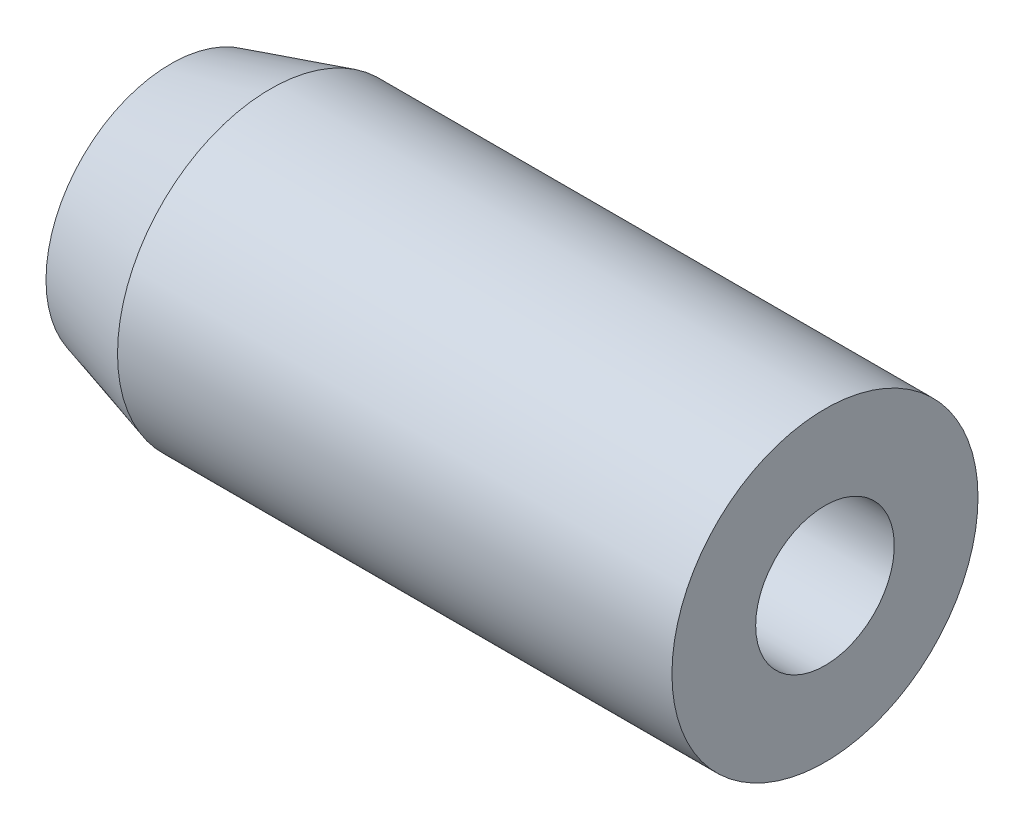
ISO-10303-21;
HEADER;
FILE_DESCRIPTION(('STEP AP214'),'2;1');
FILE_NAME('part.step','',(''),(''),'','','');
FILE_SCHEMA(('AUTOMOTIVE_DESIGN { 1 0 10303 214 1 1 1 1 }'));
ENDSEC;
DATA;
#1=APPLICATION_CONTEXT('core data for automotive mechanical design processes');
#2=APPLICATION_PROTOCOL_DEFINITION('international standard','automotive_design',2000,#1);
#3=PRODUCT_CONTEXT('',#1,'mechanical');
#4=PRODUCT('Part','Part','',(#3));
#5=PRODUCT_RELATED_PRODUCT_CATEGORY('part','',(#4));
#6=PRODUCT_DEFINITION_FORMATION('','',#4);
#7=PRODUCT_DEFINITION_CONTEXT('part definition',#1,'design');
#8=PRODUCT_DEFINITION('design','',#6,#7);
#9=PRODUCT_DEFINITION_SHAPE('','',#8);
#10=(LENGTH_UNIT() NAMED_UNIT(*) SI_UNIT(.MILLI.,.METRE.));
#11=(NAMED_UNIT(*) PLANE_ANGLE_UNIT() SI_UNIT($,.RADIAN.));
#12=(NAMED_UNIT(*) SI_UNIT($,.STERADIAN.) SOLID_ANGLE_UNIT());
#13=UNCERTAINTY_MEASURE_WITH_UNIT(LENGTH_MEASURE(1.E-05),#10,'distance_accuracy_value','');
#14=(GEOMETRIC_REPRESENTATION_CONTEXT(3) GLOBAL_UNCERTAINTY_ASSIGNED_CONTEXT((#13)) GLOBAL_UNIT_ASSIGNED_CONTEXT((#10,
#11,#12)) REPRESENTATION_CONTEXT('',''));
#15=CARTESIAN_POINT('',(0.,0.,0.));
#16=DIRECTION('',(0.,0.,1.));
#17=DIRECTION('',(1.,0.,0.));
#18=AXIS2_PLACEMENT_3D('',#15,#16,#17);
#19=CARTESIAN_POINT('',(0.,0.,0.));
#20=DIRECTION('',(-1.,0.,0.));
#21=DIRECTION('',(0.,0.,1.));
#22=AXIS2_PLACEMENT_3D('',#19,#20,#21);
#23=CYLINDRICAL_SURFACE('',#22,1.58749999999999);
#24=CARTESIAN_POINT('',(14.986,0.,0.));
#25=DIRECTION('',(-1.,0.,0.));
#26=DIRECTION('',(0.,0.,1.));
#27=AXIS2_PLACEMENT_3D('',#24,#25,#26);
#28=CIRCLE('',#27,1.58749999999999);
#29=CARTESIAN_POINT('',(14.986,0.,1.58749999999999));
#30=VERTEX_POINT('',#29);
#31=EDGE_CURVE('E377',#30,#30,#28,.T.);
#32=ORIENTED_EDGE('',*,*,#31,.F.);
#33=EDGE_LOOP('',(#32));
#34=FACE_BOUND('',#33,.T.);
#35=CARTESIAN_POINT('',(0.,0.,0.));
#36=DIRECTION('',(-1.,0.,0.));
#37=DIRECTION('',(0.,0.,1.));
#38=AXIS2_PLACEMENT_3D('',#35,#36,#37);
#39=CIRCLE('',#38,1.58749999999999);
#40=CARTESIAN_POINT('',(0.,0.,1.58749999999999));
#41=VERTEX_POINT('',#40);
#42=EDGE_CURVE('E10',#41,#41,#39,.T.);
#43=ORIENTED_EDGE('',*,*,#42,.T.);
#44=EDGE_LOOP('',(#43));
#45=FACE_BOUND('',#44,.T.);
#46=ADVANCED_FACE('F358',(#34,#45),#23,.F.);
#47=CARTESIAN_POINT('',(0.,0.,-1.58749999999999));
#48=DIRECTION('',(1.,0.,0.));
#49=DIRECTION('',(0.,0.,-1.));
#50=AXIS2_PLACEMENT_3D('',#47,#48,#49);
#51=PLANE('',#50);
#52=ORIENTED_EDGE('',*,*,#42,.F.);
#53=EDGE_LOOP('',(#52));
#54=FACE_BOUND('',#53,.T.);
#55=CARTESIAN_POINT('',(0.,0.,0.));
#56=DIRECTION('',(-1.,0.,0.));
#57=DIRECTION('',(0.,0.,1.));
#58=AXIS2_PLACEMENT_3D('',#55,#56,#57);
#59=CIRCLE('',#58,2.85749999999999);
#60=CARTESIAN_POINT('',(0.,0.,2.85749999999999));
#61=VERTEX_POINT('',#60);
#62=EDGE_CURVE('E364',#61,#61,#59,.T.);
#63=ORIENTED_EDGE('',*,*,#62,.T.);
#64=EDGE_LOOP('',(#63));
#65=FACE_BOUND('',#64,.T.);
#66=ADVANCED_FACE('F384',(#54,#65),#51,.F.);
#67=CARTESIAN_POINT('',(2.286,0.,0.));
#68=DIRECTION('',(1.,0.,0.));
#69=DIRECTION('',(0.,0.,-1.));
#70=AXIS2_PLACEMENT_3D('',#67,#68,#69);
#71=CONICAL_SURFACE('',#70,3.5052,0.27609701939544);
#72=ORIENTED_EDGE('',*,*,#62,.F.);
#73=EDGE_LOOP('',(#72));
#74=FACE_BOUND('',#73,.T.);
#75=CARTESIAN_POINT('',(2.286,0.,0.));
#76=DIRECTION('',(-1.,0.,0.));
#77=DIRECTION('',(0.,0.,1.));
#78=AXIS2_PLACEMENT_3D('',#75,#76,#77);
#79=CIRCLE('',#78,3.5052);
#80=CARTESIAN_POINT('',(2.286,0.,3.5052));
#81=VERTEX_POINT('',#80);
#82=EDGE_CURVE('E368',#81,#81,#79,.T.);
#83=ORIENTED_EDGE('',*,*,#82,.T.);
#84=EDGE_LOOP('',(#83));
#85=FACE_BOUND('',#84,.T.);
#86=ADVANCED_FACE('F388',(#74,#85),#71,.T.);
#87=CARTESIAN_POINT('',(0.,0.,0.));
#88=DIRECTION('',(-1.,0.,0.));
#89=DIRECTION('',(0.,0.,1.));
#90=AXIS2_PLACEMENT_3D('',#87,#88,#89);
#91=CYLINDRICAL_SURFACE('',#90,3.5052);
#92=ORIENTED_EDGE('',*,*,#82,.F.);
#93=EDGE_LOOP('',(#92));
#94=FACE_BOUND('',#93,.T.);
#95=CARTESIAN_POINT('',(14.986,0.,0.));
#96=DIRECTION('',(-1.,0.,0.));
#97=DIRECTION('',(0.,0.,1.));
#98=AXIS2_PLACEMENT_3D('',#95,#96,#97);
#99=CIRCLE('',#98,3.5052);
#100=CARTESIAN_POINT('',(14.986,0.,3.5052));
#101=VERTEX_POINT('',#100);
#102=EDGE_CURVE('E372',#101,#101,#99,.T.);
#103=ORIENTED_EDGE('',*,*,#102,.T.);
#104=EDGE_LOOP('',(#103));
#105=FACE_BOUND('',#104,.T.);
#106=ADVANCED_FACE('F393',(#94,#105),#91,.T.);
#107=CARTESIAN_POINT('',(14.986,0.,-3.5052));
#108=DIRECTION('',(-1.,0.,0.));
#109=DIRECTION('',(0.,0.,1.));
#110=AXIS2_PLACEMENT_3D('',#107,#108,#109);
#111=PLANE('',#110);
#112=ORIENTED_EDGE('',*,*,#102,.F.);
#113=EDGE_LOOP('',(#112));
#114=FACE_BOUND('',#113,.T.);
#115=ORIENTED_EDGE('',*,*,#31,.T.);
#116=EDGE_LOOP('',(#115));
#117=FACE_BOUND('',#116,.T.);
#118=ADVANCED_FACE('F381',(#114,#117),#111,.F.);
#119=CLOSED_SHELL('',(#46,#66,#86,#106,#118));
#120=MANIFOLD_SOLID_BREP('B2',#119);
#121=ADVANCED_BREP_SHAPE_REPRESENTATION('',(#18,#120),#14);
#122=SHAPE_DEFINITION_REPRESENTATION(#9,#121);
ENDSEC;
END-ISO-10303-21;
